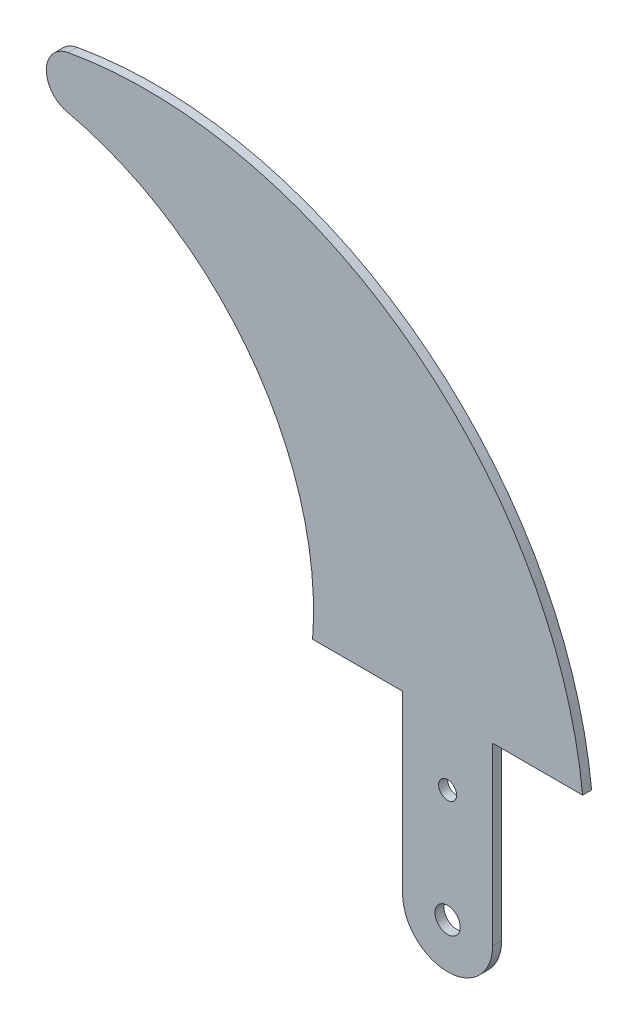
ISO-10303-21;
HEADER;
FILE_DESCRIPTION(('STEP AP214'),'2;1');
FILE_NAME('part.step','',(''),(''),'','','');
FILE_SCHEMA(('AUTOMOTIVE_DESIGN { 1 0 10303 214 1 1 1 1 }'));
ENDSEC;
DATA;
#1=APPLICATION_CONTEXT('core data for automotive mechanical design processes');
#2=APPLICATION_PROTOCOL_DEFINITION('international standard','automotive_design',2000,#1);
#3=PRODUCT_CONTEXT('',#1,'mechanical');
#4=PRODUCT('Part','Part','',(#3));
#5=PRODUCT_RELATED_PRODUCT_CATEGORY('part','',(#4));
#6=PRODUCT_DEFINITION_FORMATION('','',#4);
#7=PRODUCT_DEFINITION_CONTEXT('part definition',#1,'design');
#8=PRODUCT_DEFINITION('design','',#6,#7);
#9=PRODUCT_DEFINITION_SHAPE('','',#8);
#10=(LENGTH_UNIT() NAMED_UNIT(*) SI_UNIT(.MILLI.,.METRE.));
#11=(NAMED_UNIT(*) PLANE_ANGLE_UNIT() SI_UNIT($,.RADIAN.));
#12=(NAMED_UNIT(*) SI_UNIT($,.STERADIAN.) SOLID_ANGLE_UNIT());
#13=UNCERTAINTY_MEASURE_WITH_UNIT(LENGTH_MEASURE(1.E-05),#10,'distance_accuracy_value','');
#14=(GEOMETRIC_REPRESENTATION_CONTEXT(3) GLOBAL_UNCERTAINTY_ASSIGNED_CONTEXT((#13)) GLOBAL_UNIT_ASSIGNED_CONTEXT((#10,
#11,#12)) REPRESENTATION_CONTEXT('',''));
#15=CARTESIAN_POINT('',(0.,0.,0.));
#16=DIRECTION('',(0.,0.,1.));
#17=DIRECTION('',(1.,0.,0.));
#18=AXIS2_PLACEMENT_3D('',#15,#16,#17);
#19=CARTESIAN_POINT('',(45.2059904,-15.7615616,-1.));
#20=DIRECTION('',(0.,0.,1.));
#21=DIRECTION('',(1.,0.,0.));
#22=AXIS2_PLACEMENT_3D('',#19,#20,#21);
#23=CYLINDRICAL_SURFACE('',#22,5.);
#24=CARTESIAN_POINT('',(45.2059904,-15.7615616,0.));
#25=DIRECTION('',(0.,0.,1.));
#26=DIRECTION('',(1.,0.,0.));
#27=AXIS2_PLACEMENT_3D('',#24,#25,#26);
#28=CIRCLE('',#27,5.);
#29=CARTESIAN_POINT('',(40.2059904,-15.7615616,0.));
#30=VERTEX_POINT('',#29);
#31=CARTESIAN_POINT('',(50.2059904,-15.7615616,0.));
#32=VERTEX_POINT('',#31);
#33=EDGE_CURVE('E134',#30,#32,#28,.T.);
#34=ORIENTED_EDGE('',*,*,#33,.F.);
#35=DIRECTION('',(0.,0.,1.));
#36=VECTOR('',#35,1.);
#37=CARTESIAN_POINT('',(40.2059904,-15.7615616,-1.));
#38=LINE('',#37,#36);
#39=CARTESIAN_POINT('',(40.2059904,-15.7615616,-1.));
#40=VERTEX_POINT('',#39);
#41=EDGE_CURVE('E11',#40,#30,#38,.T.);
#42=ORIENTED_EDGE('',*,*,#41,.F.);
#43=CARTESIAN_POINT('',(45.2059904,-15.7615616,-1.));
#44=DIRECTION('',(0.,0.,1.));
#45=DIRECTION('',(1.,0.,0.));
#46=AXIS2_PLACEMENT_3D('',#43,#44,#45);
#47=CIRCLE('',#46,5.);
#48=CARTESIAN_POINT('',(50.2059904,-15.7615616,-1.));
#49=VERTEX_POINT('',#48);
#50=EDGE_CURVE('E155',#40,#49,#47,.T.);
#51=ORIENTED_EDGE('',*,*,#50,.T.);
#52=DIRECTION('',(0.,0.,1.));
#53=VECTOR('',#52,1.);
#54=CARTESIAN_POINT('',(50.2059904,-15.7615616,-1.));
#55=LINE('',#54,#53);
#56=EDGE_CURVE('E40',#49,#32,#55,.T.);
#57=ORIENTED_EDGE('',*,*,#56,.T.);
#58=EDGE_LOOP('',(#34,#42,#51,#57));
#59=FACE_BOUND('',#58,.T.);
#60=ADVANCED_FACE('F37',(#59),#23,.T.);
#61=CARTESIAN_POINT('',(40.2059904,-15.7615616,-1.));
#62=DIRECTION('',(-1.,0.,0.));
#63=DIRECTION('',(0.,0.,1.));
#64=AXIS2_PLACEMENT_3D('',#61,#62,#63);
#65=PLANE('',#64);
#66=DIRECTION('',(0.,-1.,0.));
#67=VECTOR('',#66,1.);
#68=CARTESIAN_POINT('',(40.2059904,-15.7615616,0.));
#69=LINE('',#68,#67);
#70=CARTESIAN_POINT('',(40.2059904,3.7384384,0.));
#71=VERTEX_POINT('',#70);
#72=EDGE_CURVE('E153',#71,#30,#69,.T.);
#73=ORIENTED_EDGE('',*,*,#72,.F.);
#74=DIRECTION('',(0.,0.,1.));
#75=VECTOR('',#74,1.);
#76=CARTESIAN_POINT('',(40.2059904,3.7384384,-1.));
#77=LINE('',#76,#75);
#78=CARTESIAN_POINT('',(40.2059904,3.7384384,-1.));
#79=VERTEX_POINT('',#78);
#80=EDGE_CURVE('E46',#79,#71,#77,.T.);
#81=ORIENTED_EDGE('',*,*,#80,.F.);
#82=DIRECTION('',(0.,-1.,0.));
#83=VECTOR('',#82,1.);
#84=CARTESIAN_POINT('',(40.2059904,-15.7615616,-1.));
#85=LINE('',#84,#83);
#86=EDGE_CURVE('E124',#79,#40,#85,.T.);
#87=ORIENTED_EDGE('',*,*,#86,.T.);
#88=ORIENTED_EDGE('',*,*,#41,.T.);
#89=EDGE_LOOP('',(#73,#81,#87,#88));
#90=FACE_BOUND('',#89,.T.);
#91=ADVANCED_FACE('F167',(#90),#65,.T.);
#92=CARTESIAN_POINT('',(40.2059904,3.7384384,-1.));
#93=DIRECTION('',(0.,-1.,0.));
#94=DIRECTION('',(0.,0.,-1.));
#95=AXIS2_PLACEMENT_3D('',#92,#93,#94);
#96=PLANE('',#95);
#97=DIRECTION('',(1.,0.,0.));
#98=VECTOR('',#97,1.);
#99=CARTESIAN_POINT('',(40.2059904,3.7384384,0.));
#100=LINE('',#99,#98);
#101=CARTESIAN_POINT('',(30.2059904,3.7384384,0.));
#102=VERTEX_POINT('',#101);
#103=EDGE_CURVE('E111',#102,#71,#100,.T.);
#104=ORIENTED_EDGE('',*,*,#103,.F.);
#105=DIRECTION('',(0.,0.,1.));
#106=VECTOR('',#105,1.);
#107=CARTESIAN_POINT('',(30.2059904,3.7384384,-1.));
#108=LINE('',#107,#106);
#109=CARTESIAN_POINT('',(30.2059904,3.7384384,-1.));
#110=VERTEX_POINT('',#109);
#111=EDGE_CURVE('E106',#110,#102,#108,.T.);
#112=ORIENTED_EDGE('',*,*,#111,.F.);
#113=DIRECTION('',(1.,0.,0.));
#114=VECTOR('',#113,1.);
#115=CARTESIAN_POINT('',(40.2059904,3.7384384,-1.));
#116=LINE('',#115,#114);
#117=EDGE_CURVE('E109',#110,#79,#116,.T.);
#118=ORIENTED_EDGE('',*,*,#117,.T.);
#119=ORIENTED_EDGE('',*,*,#80,.T.);
#120=EDGE_LOOP('',(#104,#112,#118,#119));
#121=FACE_BOUND('',#120,.T.);
#122=ADVANCED_FACE('F108',(#121),#96,.T.);
#123=CARTESIAN_POINT('',(-4.93243303607327,6.4912041837939,-1.));
#124=DIRECTION('',(0.,0.,1.));
#125=DIRECTION('',(1.,0.,0.));
#126=AXIS2_PLACEMENT_3D('',#123,#124,#125);
#127=CYLINDRICAL_SURFACE('',#126,35.2460851873397);
#128=CARTESIAN_POINT('',(-4.93243303607327,6.4912041837939,0.));
#129=DIRECTION('',(0.,0.,-1.));
#130=DIRECTION('',(1.,0.,0.));
#131=AXIS2_PLACEMENT_3D('',#128,#129,#130);
#132=CIRCLE('',#131,35.2460851873397);
#133=CARTESIAN_POINT('',(2.9116252651277,40.8533529873913,0.));
#134=VERTEX_POINT('',#133);
#135=EDGE_CURVE('E150',#134,#102,#132,.T.);
#136=ORIENTED_EDGE('',*,*,#135,.F.);
#137=DIRECTION('',(0.,0.,1.));
#138=VECTOR('',#137,1.);
#139=CARTESIAN_POINT('',(2.9116252651277,40.8533529873913,-1.));
#140=LINE('',#139,#138);
#141=CARTESIAN_POINT('',(2.9116252651277,40.8533529873913,-1.));
#142=VERTEX_POINT('',#141);
#143=EDGE_CURVE('E116',#142,#134,#140,.T.);
#144=ORIENTED_EDGE('',*,*,#143,.F.);
#145=CARTESIAN_POINT('',(-4.93243303607327,6.4912041837939,-1.));
#146=DIRECTION('',(0.,0.,-1.));
#147=DIRECTION('',(1.,0.,0.));
#148=AXIS2_PLACEMENT_3D('',#145,#146,#147);
#149=CIRCLE('',#148,35.2460851873397);
#150=EDGE_CURVE('E122',#142,#110,#149,.T.);
#151=ORIENTED_EDGE('',*,*,#150,.T.);
#152=ORIENTED_EDGE('',*,*,#111,.T.);
#153=EDGE_LOOP('',(#136,#144,#151,#152));
#154=FACE_BOUND('',#153,.T.);
#155=ADVANCED_FACE('F126',(#154),#127,.F.);
#156=CARTESIAN_POINT('',(3.56496453677901,43.7154098977904,-1.));
#157=DIRECTION('',(0.,0.,1.));
#158=DIRECTION('',(1.,0.,0.));
#159=AXIS2_PLACEMENT_3D('',#156,#157,#158);
#160=CYLINDRICAL_SURFACE('',#159,2.93568083453315);
#161=CARTESIAN_POINT('',(3.56496453677901,43.7154098977904,0.));
#162=DIRECTION('',(0.,0.,1.));
#163=DIRECTION('',(1.,0.,0.));
#164=AXIS2_PLACEMENT_3D('',#161,#162,#163);
#165=CIRCLE('',#164,2.93568083453315);
#166=CARTESIAN_POINT('',(3.04030015541114,46.6038262890279,0.));
#167=VERTEX_POINT('',#166);
#168=EDGE_CURVE('E147',#167,#134,#165,.T.);
#169=ORIENTED_EDGE('',*,*,#168,.F.);
#170=DIRECTION('',(0.,0.,1.));
#171=VECTOR('',#170,1.);
#172=CARTESIAN_POINT('',(3.04030015541114,46.6038262890279,-1.));
#173=LINE('',#172,#171);
#174=CARTESIAN_POINT('',(3.04030015541114,46.6038262890279,-1.));
#175=VERTEX_POINT('',#174);
#176=EDGE_CURVE('E159',#175,#167,#173,.T.);
#177=ORIENTED_EDGE('',*,*,#176,.F.);
#178=CARTESIAN_POINT('',(3.56496453677901,43.7154098977904,-1.));
#179=DIRECTION('',(0.,0.,1.));
#180=DIRECTION('',(1.,0.,0.));
#181=AXIS2_PLACEMENT_3D('',#178,#179,#180);
#182=CIRCLE('',#181,2.93568083453315);
#183=EDGE_CURVE('E127',#175,#142,#182,.T.);
#184=ORIENTED_EDGE('',*,*,#183,.T.);
#185=ORIENTED_EDGE('',*,*,#143,.T.);
#186=EDGE_LOOP('',(#169,#177,#184,#185));
#187=FACE_BOUND('',#186,.T.);
#188=ADVANCED_FACE('F180',(#187),#160,.T.);
#189=CARTESIAN_POINT('',(11.7480267852592,-1.33451529490741,-1.));
#190=DIRECTION('',(0.,0.,1.));
#191=DIRECTION('',(1.,0.,0.));
#192=AXIS2_PLACEMENT_3D('',#189,#190,#191);
#193=CYLINDRICAL_SURFACE('',#192,48.7227780086298);
#194=CARTESIAN_POINT('',(11.7480267852592,-1.33451529490741,0.));
#195=DIRECTION('',(0.,0.,1.));
#196=DIRECTION('',(1.,0.,0.));
#197=AXIS2_PLACEMENT_3D('',#194,#195,#196);
#198=CIRCLE('',#197,48.7227780086298);
#199=CARTESIAN_POINT('',(60.2059904,3.7384384,0.));
#200=VERTEX_POINT('',#199);
#201=EDGE_CURVE('E144',#200,#167,#198,.T.);
#202=ORIENTED_EDGE('',*,*,#201,.F.);
#203=DIRECTION('',(0.,0.,1.));
#204=VECTOR('',#203,1.);
#205=CARTESIAN_POINT('',(60.2059904,3.7384384,-1.));
#206=LINE('',#205,#204);
#207=CARTESIAN_POINT('',(60.2059904,3.7384384,-1.));
#208=VERTEX_POINT('',#207);
#209=EDGE_CURVE('E161',#208,#200,#206,.T.);
#210=ORIENTED_EDGE('',*,*,#209,.F.);
#211=CARTESIAN_POINT('',(11.7480267852592,-1.33451529490741,-1.));
#212=DIRECTION('',(0.,0.,1.));
#213=DIRECTION('',(1.,0.,0.));
#214=AXIS2_PLACEMENT_3D('',#211,#212,#213);
#215=CIRCLE('',#214,48.7227780086298);
#216=EDGE_CURVE('E129',#208,#175,#215,.T.);
#217=ORIENTED_EDGE('',*,*,#216,.T.);
#218=ORIENTED_EDGE('',*,*,#176,.T.);
#219=EDGE_LOOP('',(#202,#210,#217,#218));
#220=FACE_BOUND('',#219,.T.);
#221=ADVANCED_FACE('F183',(#220),#193,.T.);
#222=CARTESIAN_POINT('',(60.2059904,3.7384384,-1.));
#223=DIRECTION('',(0.,-1.,0.));
#224=DIRECTION('',(0.,0.,-1.));
#225=AXIS2_PLACEMENT_3D('',#222,#223,#224);
#226=PLANE('',#225);
#227=DIRECTION('',(1.,0.,0.));
#228=VECTOR('',#227,1.);
#229=CARTESIAN_POINT('',(60.2059904,3.7384384,0.));
#230=LINE('',#229,#228);
#231=CARTESIAN_POINT('',(50.2059904,3.7384384,0.));
#232=VERTEX_POINT('',#231);
#233=EDGE_CURVE('E141',#232,#200,#230,.T.);
#234=ORIENTED_EDGE('',*,*,#233,.F.);
#235=DIRECTION('',(0.,0.,1.));
#236=VECTOR('',#235,1.);
#237=CARTESIAN_POINT('',(50.2059904,3.7384384,-1.));
#238=LINE('',#237,#236);
#239=CARTESIAN_POINT('',(50.2059904,3.7384384,-1.));
#240=VERTEX_POINT('',#239);
#241=EDGE_CURVE('E162',#240,#232,#238,.T.);
#242=ORIENTED_EDGE('',*,*,#241,.F.);
#243=DIRECTION('',(1.,0.,0.));
#244=VECTOR('',#243,1.);
#245=CARTESIAN_POINT('',(60.2059904,3.7384384,-1.));
#246=LINE('',#245,#244);
#247=EDGE_CURVE('E229',#240,#208,#246,.T.);
#248=ORIENTED_EDGE('',*,*,#247,.T.);
#249=ORIENTED_EDGE('',*,*,#209,.T.);
#250=EDGE_LOOP('',(#234,#242,#248,#249));
#251=FACE_BOUND('',#250,.T.);
#252=ADVANCED_FACE('F187',(#251),#226,.T.);
#253=CARTESIAN_POINT('',(50.2059904,3.7384384,-1.));
#254=DIRECTION('',(1.,0.,0.));
#255=DIRECTION('',(0.,0.,-1.));
#256=AXIS2_PLACEMENT_3D('',#253,#254,#255);
#257=PLANE('',#256);
#258=DIRECTION('',(0.,1.,0.));
#259=VECTOR('',#258,1.);
#260=CARTESIAN_POINT('',(50.2059904,3.7384384,0.));
#261=LINE('',#260,#259);
#262=EDGE_CURVE('E137',#32,#232,#261,.T.);
#263=ORIENTED_EDGE('',*,*,#262,.F.);
#264=ORIENTED_EDGE('',*,*,#56,.F.);
#265=DIRECTION('',(0.,1.,0.));
#266=VECTOR('',#265,1.);
#267=CARTESIAN_POINT('',(50.2059904,3.7384384,-1.));
#268=LINE('',#267,#266);
#269=EDGE_CURVE('E227',#49,#240,#268,.T.);
#270=ORIENTED_EDGE('',*,*,#269,.T.);
#271=ORIENTED_EDGE('',*,*,#241,.T.);
#272=EDGE_LOOP('',(#263,#264,#270,#271));
#273=FACE_BOUND('',#272,.T.);
#274=ADVANCED_FACE('F164',(#273),#257,.T.);
#275=CARTESIAN_POINT('',(45.2059904,-15.7615616,-1.));
#276=DIRECTION('',(0.,0.,1.));
#277=DIRECTION('',(1.,0.,0.));
#278=AXIS2_PLACEMENT_3D('',#275,#276,#277);
#279=PLANE('',#278);
#280=CARTESIAN_POINT('',(45.2059904,-3.2615616,-1.));
#281=DIRECTION('',(0.,0.,1.));
#282=DIRECTION('',(1.,0.,0.));
#283=AXIS2_PLACEMENT_3D('',#280,#281,#282);
#284=CIRCLE('',#283,0.999999999958402);
#285=CARTESIAN_POINT('',(46.2059903999584,-3.2615616,-1.));
#286=VERTEX_POINT('',#285);
#287=EDGE_CURVE('E214',#286,#286,#284,.T.);
#288=ORIENTED_EDGE('',*,*,#287,.T.);
#289=EDGE_LOOP('',(#288));
#290=FACE_BOUND('',#289,.T.);
#291=CARTESIAN_POINT('',(45.2059904,-15.7615616,-1.));
#292=DIRECTION('',(0.,0.,1.));
#293=DIRECTION('',(1.,0.,0.));
#294=AXIS2_PLACEMENT_3D('',#291,#292,#293);
#295=CIRCLE('',#294,1.39999999995839);
#296=CARTESIAN_POINT('',(46.6059903999584,-15.7615616,-1.));
#297=VERTEX_POINT('',#296);
#298=EDGE_CURVE('E138',#297,#297,#295,.T.);
#299=ORIENTED_EDGE('',*,*,#298,.T.);
#300=EDGE_LOOP('',(#299));
#301=FACE_BOUND('',#300,.T.);
#302=ORIENTED_EDGE('',*,*,#50,.F.);
#303=ORIENTED_EDGE('',*,*,#86,.F.);
#304=ORIENTED_EDGE('',*,*,#117,.F.);
#305=ORIENTED_EDGE('',*,*,#150,.F.);
#306=ORIENTED_EDGE('',*,*,#183,.F.);
#307=ORIENTED_EDGE('',*,*,#216,.F.);
#308=ORIENTED_EDGE('',*,*,#247,.F.);
#309=ORIENTED_EDGE('',*,*,#269,.F.);
#310=EDGE_LOOP('',(#302,#303,#304,#305,#306,#307,#308,#309));
#311=FACE_BOUND('',#310,.T.);
#312=ADVANCED_FACE('F120',(#290,#301,#311),#279,.F.);
#313=CARTESIAN_POINT('',(45.2059904,-15.7615616,0.));
#314=DIRECTION('',(0.,0.,1.));
#315=DIRECTION('',(1.,0.,0.));
#316=AXIS2_PLACEMENT_3D('',#313,#314,#315);
#317=PLANE('',#316);
#318=CARTESIAN_POINT('',(45.2059904,-3.2615616,0.));
#319=DIRECTION('',(0.,0.,1.));
#320=DIRECTION('',(1.,0.,0.));
#321=AXIS2_PLACEMENT_3D('',#318,#319,#320);
#322=CIRCLE('',#321,0.999999999958402);
#323=CARTESIAN_POINT('',(46.2059903999584,-3.2615616,0.));
#324=VERTEX_POINT('',#323);
#325=EDGE_CURVE('E217',#324,#324,#322,.T.);
#326=ORIENTED_EDGE('',*,*,#325,.F.);
#327=EDGE_LOOP('',(#326));
#328=FACE_BOUND('',#327,.T.);
#329=CARTESIAN_POINT('',(45.2059904,-15.7615616,0.));
#330=DIRECTION('',(0.,0.,1.));
#331=DIRECTION('',(1.,0.,0.));
#332=AXIS2_PLACEMENT_3D('',#329,#330,#331);
#333=CIRCLE('',#332,1.39999999995839);
#334=CARTESIAN_POINT('',(46.6059903999584,-15.7615616,0.));
#335=VERTEX_POINT('',#334);
#336=EDGE_CURVE('E219',#335,#335,#333,.T.);
#337=ORIENTED_EDGE('',*,*,#336,.F.);
#338=EDGE_LOOP('',(#337));
#339=FACE_BOUND('',#338,.T.);
#340=ORIENTED_EDGE('',*,*,#33,.T.);
#341=ORIENTED_EDGE('',*,*,#262,.T.);
#342=ORIENTED_EDGE('',*,*,#233,.T.);
#343=ORIENTED_EDGE('',*,*,#201,.T.);
#344=ORIENTED_EDGE('',*,*,#168,.T.);
#345=ORIENTED_EDGE('',*,*,#135,.T.);
#346=ORIENTED_EDGE('',*,*,#103,.T.);
#347=ORIENTED_EDGE('',*,*,#72,.T.);
#348=EDGE_LOOP('',(#340,#341,#342,#343,#344,#345,#346,#347));
#349=FACE_BOUND('',#348,.T.);
#350=ADVANCED_FACE('F166',(#328,#339,#349),#317,.T.);
#351=CARTESIAN_POINT('',(45.2059904,-15.7615616,-1.));
#352=DIRECTION('',(0.,0.,1.));
#353=DIRECTION('',(1.,0.,0.));
#354=AXIS2_PLACEMENT_3D('',#351,#352,#353);
#355=CYLINDRICAL_SURFACE('',#354,1.39999999995839);
#356=ORIENTED_EDGE('',*,*,#298,.F.);
#357=EDGE_LOOP('',(#356));
#358=FACE_BOUND('',#357,.T.);
#359=ORIENTED_EDGE('',*,*,#336,.T.);
#360=EDGE_LOOP('',(#359));
#361=FACE_BOUND('',#360,.T.);
#362=ADVANCED_FACE('F199',(#358,#361),#355,.F.);
#363=CARTESIAN_POINT('',(45.2059904,-3.2615616,-1.));
#364=DIRECTION('',(0.,0.,1.));
#365=DIRECTION('',(1.,0.,0.));
#366=AXIS2_PLACEMENT_3D('',#363,#364,#365);
#367=CYLINDRICAL_SURFACE('',#366,0.999999999958402);
#368=ORIENTED_EDGE('',*,*,#287,.F.);
#369=EDGE_LOOP('',(#368));
#370=FACE_BOUND('',#369,.T.);
#371=ORIENTED_EDGE('',*,*,#325,.T.);
#372=EDGE_LOOP('',(#371));
#373=FACE_BOUND('',#372,.T.);
#374=ADVANCED_FACE('F206',(#370,#373),#367,.F.);
#375=CLOSED_SHELL('',(#60,#91,#122,#155,#188,#221,#252,#274,#312,#350,#362,#374));
#376=MANIFOLD_SOLID_BREP('B2',#375);
#377=ADVANCED_BREP_SHAPE_REPRESENTATION('',(#18,#376),#14);
#378=SHAPE_DEFINITION_REPRESENTATION(#9,#377);
ENDSEC;
END-ISO-10303-21;
